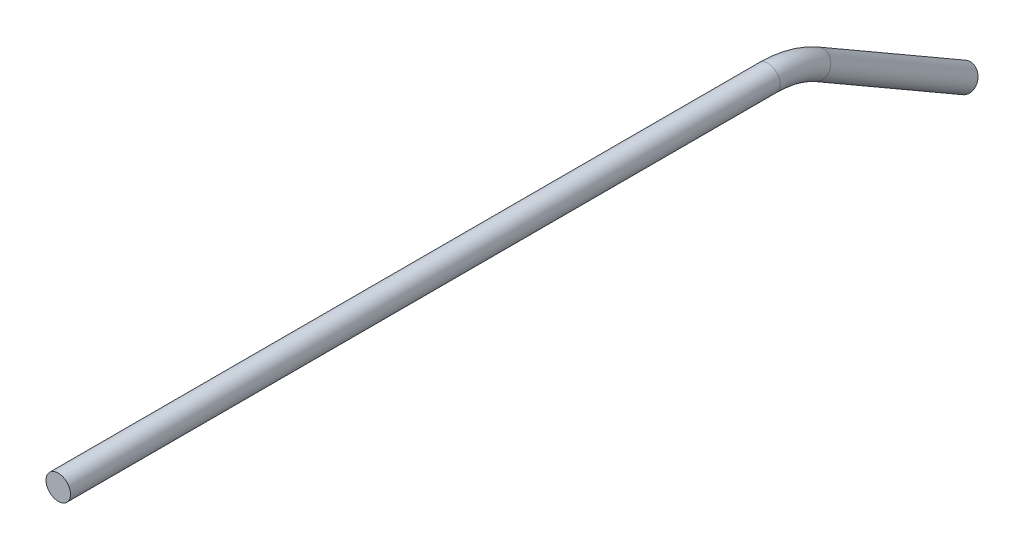
ISO-10303-21;
HEADER;
FILE_DESCRIPTION(('STEP AP214'),'2;1');
FILE_NAME('part.step','',(''),(''),'','','');
FILE_SCHEMA(('AUTOMOTIVE_DESIGN { 1 0 10303 214 1 1 1 1 }'));
ENDSEC;
DATA;
#1=APPLICATION_CONTEXT('core data for automotive mechanical design processes');
#2=APPLICATION_PROTOCOL_DEFINITION('international standard','automotive_design',2000,#1);
#3=PRODUCT_CONTEXT('',#1,'mechanical');
#4=PRODUCT('Part','Part','',(#3));
#5=PRODUCT_RELATED_PRODUCT_CATEGORY('part','',(#4));
#6=PRODUCT_DEFINITION_FORMATION('','',#4);
#7=PRODUCT_DEFINITION_CONTEXT('part definition',#1,'design');
#8=PRODUCT_DEFINITION('design','',#6,#7);
#9=PRODUCT_DEFINITION_SHAPE('','',#8);
#10=(LENGTH_UNIT() NAMED_UNIT(*) SI_UNIT(.MILLI.,.METRE.));
#11=(NAMED_UNIT(*) PLANE_ANGLE_UNIT() SI_UNIT($,.RADIAN.));
#12=(NAMED_UNIT(*) SI_UNIT($,.STERADIAN.) SOLID_ANGLE_UNIT());
#13=UNCERTAINTY_MEASURE_WITH_UNIT(LENGTH_MEASURE(1.E-05),#10,'distance_accuracy_value','');
#14=(GEOMETRIC_REPRESENTATION_CONTEXT(3) GLOBAL_UNCERTAINTY_ASSIGNED_CONTEXT((#13)) GLOBAL_UNIT_ASSIGNED_CONTEXT((#10,
#11,#12)) REPRESENTATION_CONTEXT('',''));
#15=CARTESIAN_POINT('',(0.,0.,0.));
#16=DIRECTION('',(0.,0.,1.));
#17=DIRECTION('',(1.,0.,0.));
#18=AXIS2_PLACEMENT_3D('',#15,#16,#17);
#19=CARTESIAN_POINT('',(0.,-3.40295474387527,-196.39409051225));
#20=DIRECTION('',(0.,-0.500000000000001,-0.866025403784438));
#21=DIRECTION('',(0.,0.866025403784438,-0.500000000000001));
#22=AXIS2_PLACEMENT_3D('',#19,#20,#21);
#23=CYLINDRICAL_SURFACE('',#22,3.175);
#24=CARTESIAN_POINT('',(0.,-3.40295474387527,-196.39409051225));
#25=DIRECTION('',(0.,0.500000000000001,0.866025403784438));
#26=DIRECTION('',(1.,0.,0.));
#27=AXIS2_PLACEMENT_3D('',#24,#25,#26);
#28=CIRCLE('',#27,3.175);
#29=CARTESIAN_POINT('',(0.,-0.653324086859676,-197.98159051225));
#30=VERTEX_POINT('',#29);
#31=EDGE_CURVE('E37',#30,#30,#28,.T.);
#32=ORIENTED_EDGE('',*,*,#31,.F.);
#33=EDGE_LOOP('',(#32));
#34=FACE_BOUND('',#33,.T.);
#35=CARTESIAN_POINT('',(0.,-25.4,-234.494090512249));
#36=DIRECTION('',(0.,0.500000000000001,0.866025403784438));
#37=DIRECTION('',(1.,0.,0.));
#38=AXIS2_PLACEMENT_3D('',#35,#36,#37);
#39=CIRCLE('',#38,3.175);
#40=CARTESIAN_POINT('',(3.175,-25.4,-234.494090512249));
#41=VERTEX_POINT('',#40);
#42=EDGE_CURVE('E10',#41,#41,#39,.T.);
#43=ORIENTED_EDGE('',*,*,#42,.T.);
#44=EDGE_LOOP('',(#43));
#45=FACE_BOUND('',#44,.T.);
#46=ADVANCED_FACE('F31',(#34,#45),#23,.T.);
#47=CARTESIAN_POINT('',(0.,-25.4,-183.694090512249));
#48=DIRECTION('',(-1.,0.,0.));
#49=DIRECTION('',(0.,0.,1.));
#50=AXIS2_PLACEMENT_3D('',#47,#48,#49);
#51=TOROIDAL_SURFACE('',#50,25.4,3.175);
#52=CARTESIAN_POINT('',(0.,0.,-183.694090512249));
#53=DIRECTION('',(0.,0.,1.));
#54=DIRECTION('',(1.,0.,0.));
#55=AXIS2_PLACEMENT_3D('',#52,#53,#54);
#56=CIRCLE('',#55,3.175);
#57=CARTESIAN_POINT('',(0.,3.175,-183.694090512249));
#58=VERTEX_POINT('',#57);
#59=EDGE_CURVE('E41',#58,#58,#56,.T.);
#60=CARTESIAN_POINT('',(0.,-25.4,-183.694090512249));
#61=DIRECTION('',(-1.,0.,0.));
#62=DIRECTION('',(0.,0.,1.));
#63=AXIS2_PLACEMENT_3D('',#60,#61,#62);
#64=CIRCLE('',#63,28.575);
#65=EDGE_CURVE('',#58,#30,#64,.T.);
#66=ORIENTED_EDGE('',*,*,#59,.F.);
#67=ORIENTED_EDGE('',*,*,#31,.T.);
#68=ORIENTED_EDGE('',*,*,#65,.T.);
#69=ORIENTED_EDGE('',*,*,#65,.F.);
#70=EDGE_LOOP('',(#66,#68,#67,#69));
#71=FACE_BOUND('',#70,.T.);
#72=ADVANCED_FACE('F56',(#71),#51,.T.);
#73=CARTESIAN_POINT('',(0.,0.,-183.694090512249));
#74=DIRECTION('',(0.,0.,1.));
#75=DIRECTION('',(1.,0.,0.));
#76=AXIS2_PLACEMENT_3D('',#73,#74,#75);
#77=CYLINDRICAL_SURFACE('',#76,3.175);
#78=ORIENTED_EDGE('',*,*,#59,.T.);
#79=EDGE_LOOP('',(#78));
#80=FACE_BOUND('',#79,.T.);
#81=CARTESIAN_POINT('',(0.,0.,0.));
#82=DIRECTION('',(0.,0.,1.));
#83=DIRECTION('',(1.,0.,0.));
#84=AXIS2_PLACEMENT_3D('',#81,#82,#83);
#85=CIRCLE('',#84,3.175);
#86=CARTESIAN_POINT('',(3.175,0.,0.));
#87=VERTEX_POINT('',#86);
#88=EDGE_CURVE('E45',#87,#87,#85,.T.);
#89=ORIENTED_EDGE('',*,*,#88,.F.);
#90=EDGE_LOOP('',(#89));
#91=FACE_BOUND('',#90,.T.);
#92=ADVANCED_FACE('F53',(#80,#91),#77,.T.);
#93=CARTESIAN_POINT('',(0.,-25.4,-234.494090512249));
#94=DIRECTION('',(0.,0.500000000000001,0.866025403784438));
#95=DIRECTION('',(1.,0.,0.));
#96=AXIS2_PLACEMENT_3D('',#93,#94,#95);
#97=PLANE('',#96);
#98=ORIENTED_EDGE('',*,*,#42,.F.);
#99=EDGE_LOOP('',(#98));
#100=FACE_BOUND('',#99,.T.);
#101=ADVANCED_FACE('F55',(#100),#97,.F.);
#102=CARTESIAN_POINT('',(0.,0.,0.));
#103=DIRECTION('',(0.,0.,1.));
#104=DIRECTION('',(1.,0.,0.));
#105=AXIS2_PLACEMENT_3D('',#102,#103,#104);
#106=PLANE('',#105);
#107=ORIENTED_EDGE('',*,*,#88,.T.);
#108=EDGE_LOOP('',(#107));
#109=FACE_BOUND('',#108,.T.);
#110=ADVANCED_FACE('F51',(#109),#106,.T.);
#111=CLOSED_SHELL('',(#46,#72,#92,#101,#110));
#112=MANIFOLD_SOLID_BREP('B2',#111);
#113=ADVANCED_BREP_SHAPE_REPRESENTATION('',(#18,#112),#14);
#114=SHAPE_DEFINITION_REPRESENTATION(#9,#113);
ENDSEC;
END-ISO-10303-21;
